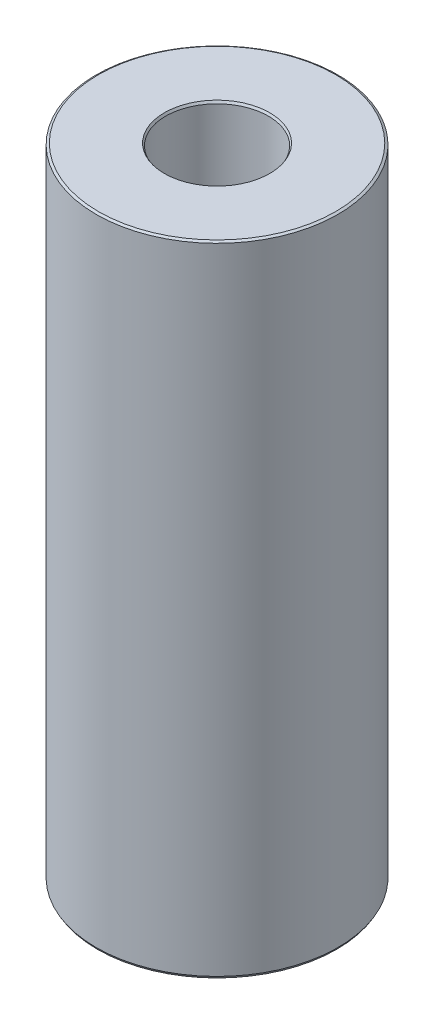
ISO-10303-21;
HEADER;
FILE_DESCRIPTION(('STEP AP214'),'2;1');
FILE_NAME('part.step','',(''),(''),'','','');
FILE_SCHEMA(('AUTOMOTIVE_DESIGN { 1 0 10303 214 1 1 1 1 }'));
ENDSEC;
DATA;
#1=APPLICATION_CONTEXT('core data for automotive mechanical design processes');
#2=APPLICATION_PROTOCOL_DEFINITION('international standard','automotive_design',2000,#1);
#3=PRODUCT_CONTEXT('',#1,'mechanical');
#4=PRODUCT('Part','Part','',(#3));
#5=PRODUCT_RELATED_PRODUCT_CATEGORY('part','',(#4));
#6=PRODUCT_DEFINITION_FORMATION('','',#4);
#7=PRODUCT_DEFINITION_CONTEXT('part definition',#1,'design');
#8=PRODUCT_DEFINITION('design','',#6,#7);
#9=PRODUCT_DEFINITION_SHAPE('','',#8);
#10=(LENGTH_UNIT() NAMED_UNIT(*) SI_UNIT(.MILLI.,.METRE.));
#11=(NAMED_UNIT(*) PLANE_ANGLE_UNIT() SI_UNIT($,.RADIAN.));
#12=(NAMED_UNIT(*) SI_UNIT($,.STERADIAN.) SOLID_ANGLE_UNIT());
#13=UNCERTAINTY_MEASURE_WITH_UNIT(LENGTH_MEASURE(1.E-05),#10,'distance_accuracy_value','');
#14=(GEOMETRIC_REPRESENTATION_CONTEXT(3) GLOBAL_UNCERTAINTY_ASSIGNED_CONTEXT((#13)) GLOBAL_UNIT_ASSIGNED_CONTEXT((#10,
#11,#12)) REPRESENTATION_CONTEXT('',''));
#15=CARTESIAN_POINT('',(0.,0.,0.));
#16=DIRECTION('',(0.,0.,1.));
#17=DIRECTION('',(1.,0.,0.));
#18=AXIS2_PLACEMENT_3D('',#15,#16,#17);
#19=CARTESIAN_POINT('',(0.,290.506111423211,0.));
#20=DIRECTION('',(0.,-1.,0.));
#21=DIRECTION('',(0.,0.,-1.));
#22=AXIS2_PLACEMENT_3D('',#19,#20,#21);
#23=CYLINDRICAL_SURFACE('',#22,55.);
#24=CARTESIAN_POINT('',(0.,1.03308464887397,0.));
#25=DIRECTION('',(0.,1.,0.));
#26=DIRECTION('',(0.,0.,1.));
#27=AXIS2_PLACEMENT_3D('',#24,#25,#26);
#28=CIRCLE('',#27,55.);
#29=CARTESIAN_POINT('',(0.,1.03308464887397,55.));
#30=VERTEX_POINT('',#29);
#31=EDGE_CURVE('E10',#30,#30,#28,.T.);
#32=ORIENTED_EDGE('',*,*,#31,.T.);
#33=EDGE_LOOP('',(#32));
#34=FACE_BOUND('',#33,.T.);
#35=CARTESIAN_POINT('',(0.,289.909659723087,0.));
#36=DIRECTION('',(0.,1.,0.));
#37=DIRECTION('',(0.,0.,1.));
#38=AXIS2_PLACEMENT_3D('',#35,#36,#37);
#39=CIRCLE('',#38,55.);
#40=CARTESIAN_POINT('',(0.,289.909659723087,55.));
#41=VERTEX_POINT('',#40);
#42=EDGE_CURVE('E50',#41,#41,#39,.F.);
#43=ORIENTED_EDGE('',*,*,#42,.T.);
#44=EDGE_LOOP('',(#43));
#45=FACE_BOUND('',#44,.T.);
#46=ADVANCED_FACE('F39',(#34,#45),#23,.T.);
#47=CARTESIAN_POINT('',(0.,290.506111423211,0.));
#48=DIRECTION('',(0.,1.,0.));
#49=DIRECTION('',(0.,0.,1.));
#50=AXIS2_PLACEMENT_3D('',#47,#48,#49);
#51=PLANE('',#50);
#52=CARTESIAN_POINT('',(0.,290.506111423211,0.));
#53=DIRECTION('',(0.,1.,0.));
#54=DIRECTION('',(0.,0.,1.));
#55=AXIS2_PLACEMENT_3D('',#52,#53,#54);
#56=CIRCLE('',#55,23.9719113395126);
#57=CARTESIAN_POINT('',(0.,290.506111423211,23.9719113395126));
#58=VERTEX_POINT('',#57);
#59=EDGE_CURVE('E58',#58,#58,#56,.F.);
#60=ORIENTED_EDGE('',*,*,#59,.T.);
#61=EDGE_LOOP('',(#60));
#62=FACE_BOUND('',#61,.T.);
#63=CARTESIAN_POINT('',(0.,290.506111423211,0.));
#64=DIRECTION('',(0.,1.,0.));
#65=DIRECTION('',(0.,0.,1.));
#66=AXIS2_PLACEMENT_3D('',#63,#64,#65);
#67=CIRCLE('',#66,53.9669153511258);
#68=CARTESIAN_POINT('',(0.,290.506111423211,53.9669153511258));
#69=VERTEX_POINT('',#68);
#70=EDGE_CURVE('E61',#69,#69,#67,.T.);
#71=ORIENTED_EDGE('',*,*,#70,.T.);
#72=EDGE_LOOP('',(#71));
#73=FACE_BOUND('',#72,.T.);
#74=ADVANCED_FACE('F88',(#62,#73),#51,.T.);
#75=CARTESIAN_POINT('',(0.,0.,0.));
#76=DIRECTION('',(0.,1.,0.));
#77=DIRECTION('',(0.,0.,1.));
#78=AXIS2_PLACEMENT_3D('',#75,#76,#77);
#79=PLANE('',#78);
#80=CARTESIAN_POINT('',(0.,0.,0.));
#81=DIRECTION('',(0.,1.,0.));
#82=DIRECTION('',(0.,0.,1.));
#83=AXIS2_PLACEMENT_3D('',#80,#81,#82);
#84=CIRCLE('',#83,24.4085442882634);
#85=CARTESIAN_POINT('',(0.,0.,24.4085442882634));
#86=VERTEX_POINT('',#85);
#87=EDGE_CURVE('E51',#86,#86,#84,.T.);
#88=ORIENTED_EDGE('',*,*,#87,.T.);
#89=EDGE_LOOP('',(#88));
#90=FACE_BOUND('',#89,.T.);
#91=CARTESIAN_POINT('',(0.,0.,0.));
#92=DIRECTION('',(0.,1.,0.));
#93=DIRECTION('',(0.,0.,1.));
#94=AXIS2_PLACEMENT_3D('',#91,#92,#93);
#95=CIRCLE('',#94,54.403548299877);
#96=CARTESIAN_POINT('',(0.,0.,54.403548299877));
#97=VERTEX_POINT('',#96);
#98=EDGE_CURVE('E54',#97,#97,#95,.F.);
#99=ORIENTED_EDGE('',*,*,#98,.T.);
#100=EDGE_LOOP('',(#99));
#101=FACE_BOUND('',#100,.T.);
#102=ADVANCED_FACE('F83',(#90,#101),#79,.F.);
#103=CARTESIAN_POINT('',(0.,290.506111423211,0.));
#104=DIRECTION('',(0.,-1.,0.));
#105=DIRECTION('',(0.,0.,-1.));
#106=AXIS2_PLACEMENT_3D('',#103,#104,#105);
#107=CYLINDRICAL_SURFACE('',#106,23.3754596393893);
#108=CARTESIAN_POINT('',(0.,289.473026774336,0.));
#109=DIRECTION('',(0.,1.,0.));
#110=DIRECTION('',(0.,0.,1.));
#111=AXIS2_PLACEMENT_3D('',#108,#109,#110);
#112=CIRCLE('',#111,23.3754596393893);
#113=CARTESIAN_POINT('',(0.,289.473026774336,23.3754596393893));
#114=VERTEX_POINT('',#113);
#115=EDGE_CURVE('E67',#114,#114,#112,.T.);
#116=ORIENTED_EDGE('',*,*,#115,.T.);
#117=EDGE_LOOP('',(#116));
#118=FACE_BOUND('',#117,.T.);
#119=CARTESIAN_POINT('',(0.,0.596451700123124,0.));
#120=DIRECTION('',(0.,1.,0.));
#121=DIRECTION('',(0.,0.,1.));
#122=AXIS2_PLACEMENT_3D('',#119,#120,#121);
#123=CIRCLE('',#122,23.3754596393893);
#124=CARTESIAN_POINT('',(0.,0.596451700123124,23.3754596393893));
#125=VERTEX_POINT('',#124);
#126=EDGE_CURVE('E69',#125,#125,#123,.F.);
#127=ORIENTED_EDGE('',*,*,#126,.T.);
#128=EDGE_LOOP('',(#127));
#129=FACE_BOUND('',#128,.T.);
#130=ADVANCED_FACE('F71',(#118,#129),#107,.F.);
#131=CARTESIAN_POINT('',(0.,289.473026774336,0.));
#132=DIRECTION('',(0.,1.,0.));
#133=DIRECTION('',(0.,0.,1.));
#134=AXIS2_PLACEMENT_3D('',#131,#132,#133);
#135=CONICAL_SURFACE('',#134,23.3754596393893,0.523598775598321);
#136=ORIENTED_EDGE('',*,*,#59,.F.);
#137=EDGE_LOOP('',(#136));
#138=FACE_BOUND('',#137,.T.);
#139=ORIENTED_EDGE('',*,*,#115,.F.);
#140=EDGE_LOOP('',(#139));
#141=FACE_BOUND('',#140,.T.);
#142=ADVANCED_FACE('F77',(#138,#141),#135,.F.);
#143=CARTESIAN_POINT('',(0.,0.,0.));
#144=DIRECTION('',(0.,-1.,0.));
#145=DIRECTION('',(0.,0.,-1.));
#146=AXIS2_PLACEMENT_3D('',#143,#144,#145);
#147=CONICAL_SURFACE('',#146,24.4085442882634,1.04719755119661);
#148=ORIENTED_EDGE('',*,*,#126,.F.);
#149=EDGE_LOOP('',(#148));
#150=FACE_BOUND('',#149,.T.);
#151=ORIENTED_EDGE('',*,*,#87,.F.);
#152=EDGE_LOOP('',(#151));
#153=FACE_BOUND('',#152,.T.);
#154=ADVANCED_FACE('F73',(#150,#153),#147,.F.);
#155=CARTESIAN_POINT('',(0.,1.03308464887397,0.));
#156=DIRECTION('',(0.,1.,0.));
#157=DIRECTION('',(0.,0.,1.));
#158=AXIS2_PLACEMENT_3D('',#155,#156,#157);
#159=CONICAL_SURFACE('',#158,55.,0.523598775598291);
#160=ORIENTED_EDGE('',*,*,#98,.F.);
#161=EDGE_LOOP('',(#160));
#162=FACE_BOUND('',#161,.T.);
#163=ORIENTED_EDGE('',*,*,#31,.F.);
#164=EDGE_LOOP('',(#163));
#165=FACE_BOUND('',#164,.T.);
#166=ADVANCED_FACE('F76',(#162,#165),#159,.T.);
#167=CARTESIAN_POINT('',(0.,290.506111423211,0.));
#168=DIRECTION('',(0.,-1.,0.));
#169=DIRECTION('',(0.,0.,-1.));
#170=AXIS2_PLACEMENT_3D('',#167,#168,#169);
#171=CONICAL_SURFACE('',#170,53.9669153511258,1.04719755119663);
#172=ORIENTED_EDGE('',*,*,#42,.F.);
#173=EDGE_LOOP('',(#172));
#174=FACE_BOUND('',#173,.T.);
#175=ORIENTED_EDGE('',*,*,#70,.F.);
#176=EDGE_LOOP('',(#175));
#177=FACE_BOUND('',#176,.T.);
#178=ADVANCED_FACE('F45',(#174,#177),#171,.T.);
#179=CLOSED_SHELL('',(#46,#74,#102,#130,#142,#154,#166,#178));
#180=MANIFOLD_SOLID_BREP('B2',#179);
#181=ADVANCED_BREP_SHAPE_REPRESENTATION('',(#18,#180),#14);
#182=SHAPE_DEFINITION_REPRESENTATION(#9,#181);
ENDSEC;
END-ISO-10303-21;
